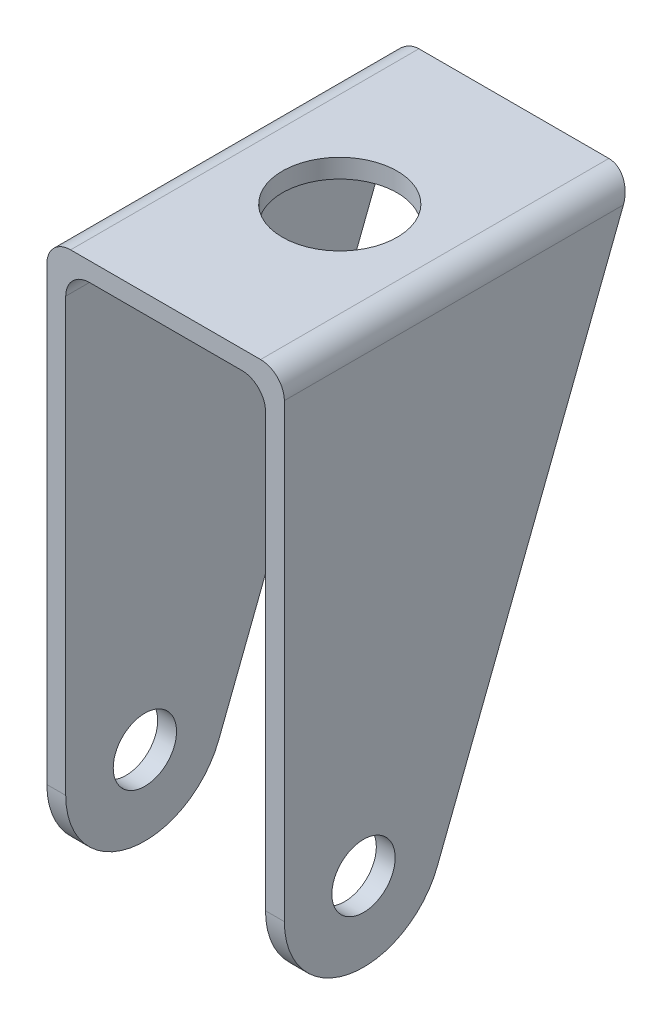
ISO-10303-21;
HEADER;
FILE_DESCRIPTION(('STEP AP214'),'2;1');
FILE_NAME('part.step','',(''),(''),'','','');
FILE_SCHEMA(('AUTOMOTIVE_DESIGN { 1 0 10303 214 1 1 1 1 }'));
ENDSEC;
DATA;
#1=APPLICATION_CONTEXT('core data for automotive mechanical design processes');
#2=APPLICATION_PROTOCOL_DEFINITION('international standard','automotive_design',2000,#1);
#3=PRODUCT_CONTEXT('',#1,'mechanical');
#4=PRODUCT('Part','Part','',(#3));
#5=PRODUCT_RELATED_PRODUCT_CATEGORY('part','',(#4));
#6=PRODUCT_DEFINITION_FORMATION('','',#4);
#7=PRODUCT_DEFINITION_CONTEXT('part definition',#1,'design');
#8=PRODUCT_DEFINITION('design','',#6,#7);
#9=PRODUCT_DEFINITION_SHAPE('','',#8);
#10=(LENGTH_UNIT() NAMED_UNIT(*) SI_UNIT(.MILLI.,.METRE.));
#11=(NAMED_UNIT(*) PLANE_ANGLE_UNIT() SI_UNIT($,.RADIAN.));
#12=(NAMED_UNIT(*) SI_UNIT($,.STERADIAN.) SOLID_ANGLE_UNIT());
#13=UNCERTAINTY_MEASURE_WITH_UNIT(LENGTH_MEASURE(1.E-05),#10,'distance_accuracy_value','');
#14=(GEOMETRIC_REPRESENTATION_CONTEXT(3) GLOBAL_UNCERTAINTY_ASSIGNED_CONTEXT((#13)) GLOBAL_UNIT_ASSIGNED_CONTEXT((#10,
#11,#12)) REPRESENTATION_CONTEXT('',''));
#15=CARTESIAN_POINT('',(0.,0.,0.));
#16=DIRECTION('',(0.,0.,1.));
#17=DIRECTION('',(1.,0.,0.));
#18=AXIS2_PLACEMENT_3D('',#15,#16,#17);
#19=CARTESIAN_POINT('',(-9.61999999999999,-5.38,0.));
#20=DIRECTION('',(0.,0.,-1.));
#21=DIRECTION('',(-1.,0.,0.));
#22=AXIS2_PLACEMENT_3D('',#19,#20,#21);
#23=CYLINDRICAL_SURFACE('',#22,3.);
#24=DIRECTION('',(0.,0.,-1.));
#25=VECTOR('',#24,1.);
#26=CARTESIAN_POINT('',(-9.61999999999999,-2.38,0.));
#27=LINE('',#26,#25);
#28=CARTESIAN_POINT('',(-9.62,-2.38,22.));
#29=VERTEX_POINT('',#28);
#30=CARTESIAN_POINT('',(-9.62,-2.38,-21.0767972413711));
#31=VERTEX_POINT('',#30);
#32=EDGE_CURVE('E214',#29,#31,#27,.T.);
#33=ORIENTED_EDGE('',*,*,#32,.F.);
#34=CARTESIAN_POINT('',(-9.61999999999999,-5.38,22.));
#35=DIRECTION('',(0.,0.,1.));
#36=DIRECTION('',(1.,0.,0.));
#37=AXIS2_PLACEMENT_3D('',#34,#35,#36);
#38=CIRCLE('',#37,3.);
#39=CARTESIAN_POINT('',(-12.62,-5.38,22.));
#40=VERTEX_POINT('',#39);
#41=EDGE_CURVE('E219',#29,#40,#38,.T.);
#42=ORIENTED_EDGE('',*,*,#41,.T.);
#43=DIRECTION('',(0.,0.,-1.));
#44=VECTOR('',#43,1.);
#45=CARTESIAN_POINT('',(-12.62,-5.38,12.));
#46=LINE('',#45,#44);
#47=CARTESIAN_POINT('',(-12.62,-5.38,-19.9130962851162));
#48=VERTEX_POINT('',#47);
#49=EDGE_CURVE('E217',#48,#40,#46,.F.);
#50=ORIENTED_EDGE('',*,*,#49,.F.);
#51=CARTESIAN_POINT('',(-9.61999999999999,-5.38,-19.9130962851162));
#52=DIRECTION('',(0.,-0.361645543914119,-0.932315665730798));
#53=DIRECTION('',(0.,0.932315665730798,-0.361645543914119));
#54=AXIS2_PLACEMENT_3D('',#51,#52,#53);
#55=ELLIPSE('',#54,3.21779426247058,3.);
#56=EDGE_CURVE('E130',#48,#31,#55,.T.);
#57=ORIENTED_EDGE('',*,*,#56,.T.);
#58=EDGE_LOOP('',(#33,#42,#50,#57));
#59=FACE_BOUND('',#58,.T.);
#60=ADVANCED_FACE('F33',(#59),#23,.F.);
#61=CARTESIAN_POINT('',(9.62,-5.38,0.));
#62=DIRECTION('',(0.,0.,1.));
#63=DIRECTION('',(1.,0.,0.));
#64=AXIS2_PLACEMENT_3D('',#61,#62,#63);
#65=CYLINDRICAL_SURFACE('',#64,3.);
#66=DIRECTION('',(0.,0.,1.));
#67=VECTOR('',#66,1.);
#68=CARTESIAN_POINT('',(9.62,-2.38,0.));
#69=LINE('',#68,#67);
#70=CARTESIAN_POINT('',(9.62,-2.38,-21.0767972413711));
#71=VERTEX_POINT('',#70);
#72=CARTESIAN_POINT('',(9.62,-2.38,22.));
#73=VERTEX_POINT('',#72);
#74=EDGE_CURVE('E202',#71,#73,#69,.T.);
#75=ORIENTED_EDGE('',*,*,#74,.F.);
#76=CARTESIAN_POINT('',(9.62,-5.38,-19.9130962851162));
#77=DIRECTION('',(0.,-0.361645543914119,-0.932315665730798));
#78=DIRECTION('',(0.,-0.932315665730798,0.361645543914119));
#79=AXIS2_PLACEMENT_3D('',#76,#77,#78);
#80=ELLIPSE('',#79,3.21779426247058,3.);
#81=CARTESIAN_POINT('',(12.62,-5.38,-19.9130962851162));
#82=VERTEX_POINT('',#81);
#83=EDGE_CURVE('E209',#71,#82,#80,.T.);
#84=ORIENTED_EDGE('',*,*,#83,.T.);
#85=DIRECTION('',(0.,0.,1.));
#86=VECTOR('',#85,1.);
#87=CARTESIAN_POINT('',(12.62,-5.38,12.));
#88=LINE('',#87,#86);
#89=CARTESIAN_POINT('',(12.62,-5.38,22.));
#90=VERTEX_POINT('',#89);
#91=EDGE_CURVE('E206',#90,#82,#88,.F.);
#92=ORIENTED_EDGE('',*,*,#91,.F.);
#93=CARTESIAN_POINT('',(9.62,-5.38,22.));
#94=DIRECTION('',(0.,0.,1.));
#95=DIRECTION('',(1.,0.,0.));
#96=AXIS2_PLACEMENT_3D('',#93,#94,#95);
#97=CIRCLE('',#96,3.);
#98=EDGE_CURVE('E211',#90,#73,#97,.T.);
#99=ORIENTED_EDGE('',*,*,#98,.T.);
#100=EDGE_LOOP('',(#75,#84,#92,#99));
#101=FACE_BOUND('',#100,.T.);
#102=ADVANCED_FACE('F259',(#101),#65,.F.);
#103=CARTESIAN_POINT('',(0.,-2.38,0.));
#104=DIRECTION('',(0.,-1.,0.));
#105=DIRECTION('',(0.,0.,-1.));
#106=AXIS2_PLACEMENT_3D('',#103,#104,#105);
#107=PLANE('',#106);
#108=CARTESIAN_POINT('',(0.,-2.38,0.));
#109=DIRECTION('',(0.,1.,0.));
#110=DIRECTION('',(0.,0.,1.));
#111=AXIS2_PLACEMENT_3D('',#108,#109,#110);
#112=CIRCLE('',#111,7.25);
#113=CARTESIAN_POINT('',(0.,-2.38,7.24999999999999));
#114=VERTEX_POINT('',#113);
#115=EDGE_CURVE('E186',#114,#114,#112,.T.);
#116=ORIENTED_EDGE('',*,*,#115,.T.);
#117=EDGE_LOOP('',(#116));
#118=FACE_BOUND('',#117,.T.);
#119=DIRECTION('',(1.,0.,0.));
#120=VECTOR('',#119,1.);
#121=CARTESIAN_POINT('',(-15.,-2.38,22.));
#122=LINE('',#121,#120);
#123=EDGE_CURVE('E192',#29,#73,#122,.T.);
#124=ORIENTED_EDGE('',*,*,#123,.F.);
#125=ORIENTED_EDGE('',*,*,#32,.T.);
#126=DIRECTION('',(1.,0.,0.));
#127=VECTOR('',#126,1.);
#128=CARTESIAN_POINT('',(-15.,-2.38,-21.0767972413711));
#129=LINE('',#128,#127);
#130=EDGE_CURVE('E159',#31,#71,#129,.T.);
#131=ORIENTED_EDGE('',*,*,#130,.T.);
#132=ORIENTED_EDGE('',*,*,#74,.T.);
#133=EDGE_LOOP('',(#124,#125,#131,#132));
#134=FACE_BOUND('',#133,.T.);
#135=ADVANCED_FACE('F262',(#118,#134),#107,.T.);
#136=CARTESIAN_POINT('',(15.,-2.38,22.));
#137=DIRECTION('',(1.,0.,0.));
#138=DIRECTION('',(0.,0.,-1.));
#139=AXIS2_PLACEMENT_3D('',#136,#137,#138);
#140=PLANE('',#139);
#141=DIRECTION('',(0.,0.932315665730798,-0.361645543914119));
#142=VECTOR('',#141,1.);
#143=CARTESIAN_POINT('',(15.,0.,-22.));
#144=LINE('',#143,#142);
#145=CARTESIAN_POINT('',(15.,-63.6164554391412,2.676843342692));
#146=VERTEX_POINT('',#145);
#147=CARTESIAN_POINT('',(15.,-3.,-20.8362990437451));
#148=VERTEX_POINT('',#147);
#149=EDGE_CURVE('E172',#146,#148,#144,.T.);
#150=ORIENTED_EDGE('',*,*,#149,.T.);
#151=DIRECTION('',(0.,0.,-1.));
#152=VECTOR('',#151,1.);
#153=CARTESIAN_POINT('',(15.,-3.,22.));
#154=LINE('',#153,#152);
#155=CARTESIAN_POINT('',(15.,-3.,22.));
#156=VERTEX_POINT('',#155);
#157=EDGE_CURVE('E56',#148,#156,#154,.F.);
#158=ORIENTED_EDGE('',*,*,#157,.T.);
#159=DIRECTION('',(0.,1.,0.));
#160=VECTOR('',#159,1.);
#161=CARTESIAN_POINT('',(15.,-2.38,22.));
#162=LINE('',#161,#160);
#163=CARTESIAN_POINT('',(15.,-60.,22.));
#164=VERTEX_POINT('',#163);
#165=EDGE_CURVE('E200',#164,#156,#162,.T.);
#166=ORIENTED_EDGE('',*,*,#165,.F.);
#167=CARTESIAN_POINT('',(15.,-60.,12.));
#168=DIRECTION('',(1.,0.,0.));
#169=DIRECTION('',(0.,0.,-1.));
#170=AXIS2_PLACEMENT_3D('',#167,#168,#169);
#171=CIRCLE('',#170,10.);
#172=EDGE_CURVE('E165',#164,#146,#171,.T.);
#173=ORIENTED_EDGE('',*,*,#172,.T.);
#174=EDGE_LOOP('',(#150,#158,#166,#173));
#175=FACE_BOUND('',#174,.T.);
#176=CARTESIAN_POINT('',(15.,-60.,12.));
#177=DIRECTION('',(1.,0.,0.));
#178=DIRECTION('',(0.,0.,-1.));
#179=AXIS2_PLACEMENT_3D('',#176,#177,#178);
#180=CIRCLE('',#179,4.);
#181=CARTESIAN_POINT('',(15.,-60.,7.99999999999999));
#182=VERTEX_POINT('',#181);
#183=EDGE_CURVE('E161',#182,#182,#180,.T.);
#184=ORIENTED_EDGE('',*,*,#183,.F.);
#185=EDGE_LOOP('',(#184));
#186=FACE_BOUND('',#185,.T.);
#187=ADVANCED_FACE('F243',(#175,#186),#140,.T.);
#188=CARTESIAN_POINT('',(-15.,-2.38,22.));
#189=DIRECTION('',(0.,0.,1.));
#190=DIRECTION('',(1.,0.,0.));
#191=AXIS2_PLACEMENT_3D('',#188,#189,#190);
#192=PLANE('',#191);
#193=ORIENTED_EDGE('',*,*,#165,.T.);
#194=CARTESIAN_POINT('',(12.,-3.,22.));
#195=DIRECTION('',(0.,0.,1.));
#196=DIRECTION('',(1.,0.,0.));
#197=AXIS2_PLACEMENT_3D('',#194,#195,#196);
#198=CIRCLE('',#197,3.);
#199=CARTESIAN_POINT('',(12.,0.,22.));
#200=VERTEX_POINT('',#199);
#201=EDGE_CURVE('E41',#156,#200,#198,.T.);
#202=ORIENTED_EDGE('',*,*,#201,.T.);
#203=DIRECTION('',(1.,0.,0.));
#204=VECTOR('',#203,1.);
#205=CARTESIAN_POINT('',(-15.,0.,22.));
#206=LINE('',#205,#204);
#207=CARTESIAN_POINT('',(-12.,0.,22.));
#208=VERTEX_POINT('',#207);
#209=EDGE_CURVE('E195',#208,#200,#206,.T.);
#210=ORIENTED_EDGE('',*,*,#209,.F.);
#211=CARTESIAN_POINT('',(-12.,-3.,22.));
#212=DIRECTION('',(0.,0.,1.));
#213=DIRECTION('',(1.,0.,0.));
#214=AXIS2_PLACEMENT_3D('',#211,#212,#213);
#215=CIRCLE('',#214,3.);
#216=CARTESIAN_POINT('',(-15.,-3.,22.));
#217=VERTEX_POINT('',#216);
#218=EDGE_CURVE('E48',#208,#217,#215,.T.);
#219=ORIENTED_EDGE('',*,*,#218,.T.);
#220=DIRECTION('',(0.,1.,0.));
#221=VECTOR('',#220,1.);
#222=CARTESIAN_POINT('',(-15.,-2.38,22.));
#223=LINE('',#222,#221);
#224=CARTESIAN_POINT('',(-15.,-60.,22.));
#225=VERTEX_POINT('',#224);
#226=EDGE_CURVE('E194',#225,#217,#223,.T.);
#227=ORIENTED_EDGE('',*,*,#226,.F.);
#228=DIRECTION('',(-1.,0.,0.));
#229=VECTOR('',#228,1.);
#230=CARTESIAN_POINT('',(-12.62,-60.,22.));
#231=LINE('',#230,#229);
#232=CARTESIAN_POINT('',(-12.62,-60.,22.));
#233=VERTEX_POINT('',#232);
#234=EDGE_CURVE('E144',#233,#225,#231,.T.);
#235=ORIENTED_EDGE('',*,*,#234,.F.);
#236=DIRECTION('',(0.,1.,0.));
#237=VECTOR('',#236,1.);
#238=CARTESIAN_POINT('',(-12.62,0.,22.));
#239=LINE('',#238,#237);
#240=EDGE_CURVE('E145',#233,#40,#239,.T.);
#241=ORIENTED_EDGE('',*,*,#240,.T.);
#242=ORIENTED_EDGE('',*,*,#41,.F.);
#243=ORIENTED_EDGE('',*,*,#123,.T.);
#244=ORIENTED_EDGE('',*,*,#98,.F.);
#245=DIRECTION('',(0.,-1.,0.));
#246=VECTOR('',#245,1.);
#247=CARTESIAN_POINT('',(12.62,-60.,22.));
#248=LINE('',#247,#246);
#249=CARTESIAN_POINT('',(12.62,-60.,22.));
#250=VERTEX_POINT('',#249);
#251=EDGE_CURVE('E175',#90,#250,#248,.T.);
#252=ORIENTED_EDGE('',*,*,#251,.T.);
#253=DIRECTION('',(1.,0.,0.));
#254=VECTOR('',#253,1.);
#255=CARTESIAN_POINT('',(12.62,-60.,22.));
#256=LINE('',#255,#254);
#257=EDGE_CURVE('E181',#250,#164,#256,.T.);
#258=ORIENTED_EDGE('',*,*,#257,.T.);
#259=EDGE_LOOP('',(#193,#202,#210,#219,#227,#235,#241,#242,#243,#244,#252,#258));
#260=FACE_BOUND('',#259,.T.);
#261=ADVANCED_FACE('F234',(#260),#192,.T.);
#262=CARTESIAN_POINT('',(-15.,-2.38,22.));
#263=DIRECTION('',(-1.,0.,0.));
#264=DIRECTION('',(0.,0.,1.));
#265=AXIS2_PLACEMENT_3D('',#262,#263,#264);
#266=PLANE('',#265);
#267=ORIENTED_EDGE('',*,*,#226,.T.);
#268=DIRECTION('',(0.,0.,1.));
#269=VECTOR('',#268,1.);
#270=CARTESIAN_POINT('',(-15.,-3.,-22.));
#271=LINE('',#270,#269);
#272=CARTESIAN_POINT('',(-15.,-3.,-20.8362990437451));
#273=VERTEX_POINT('',#272);
#274=EDGE_CURVE('E11',#217,#273,#271,.F.);
#275=ORIENTED_EDGE('',*,*,#274,.T.);
#276=DIRECTION('',(0.,-0.932315665730798,0.36164554391412));
#277=VECTOR('',#276,1.);
#278=CARTESIAN_POINT('',(-15.,0.,-22.));
#279=LINE('',#278,#277);
#280=CARTESIAN_POINT('',(-15.,-63.6164554391412,2.676843342692));
#281=VERTEX_POINT('',#280);
#282=EDGE_CURVE('E156',#273,#281,#279,.T.);
#283=ORIENTED_EDGE('',*,*,#282,.T.);
#284=CARTESIAN_POINT('',(-15.,-60.,12.));
#285=DIRECTION('',(-1.,0.,0.));
#286=DIRECTION('',(0.,0.,1.));
#287=AXIS2_PLACEMENT_3D('',#284,#285,#286);
#288=CIRCLE('',#287,10.);
#289=EDGE_CURVE('E136',#281,#225,#288,.T.);
#290=ORIENTED_EDGE('',*,*,#289,.T.);
#291=EDGE_LOOP('',(#267,#275,#283,#290));
#292=FACE_BOUND('',#291,.T.);
#293=CARTESIAN_POINT('',(-15.,-60.,12.));
#294=DIRECTION('',(-1.,0.,0.));
#295=DIRECTION('',(0.,0.,1.));
#296=AXIS2_PLACEMENT_3D('',#293,#294,#295);
#297=CIRCLE('',#296,4.);
#298=CARTESIAN_POINT('',(-15.,-60.,16.));
#299=VERTEX_POINT('',#298);
#300=EDGE_CURVE('E321',#299,#299,#297,.T.);
#301=ORIENTED_EDGE('',*,*,#300,.F.);
#302=EDGE_LOOP('',(#301));
#303=FACE_BOUND('',#302,.T.);
#304=ADVANCED_FACE('F266',(#292,#303),#266,.T.);
#305=CARTESIAN_POINT('',(0.,0.,0.));
#306=DIRECTION('',(0.,-1.,0.));
#307=DIRECTION('',(0.,0.,-1.));
#308=AXIS2_PLACEMENT_3D('',#305,#306,#307);
#309=PLANE('',#308);
#310=ORIENTED_EDGE('',*,*,#209,.T.);
#311=DIRECTION('',(0.,0.,-1.));
#312=VECTOR('',#311,1.);
#313=CARTESIAN_POINT('',(12.,0.,-22.));
#314=LINE('',#313,#312);
#315=CARTESIAN_POINT('',(12.,0.,-22.));
#316=VERTEX_POINT('',#315);
#317=EDGE_CURVE('E225',#200,#316,#314,.T.);
#318=ORIENTED_EDGE('',*,*,#317,.T.);
#319=DIRECTION('',(-1.,0.,0.));
#320=VECTOR('',#319,1.);
#321=CARTESIAN_POINT('',(-15.,0.,-22.));
#322=LINE('',#321,#320);
#323=CARTESIAN_POINT('',(-12.,0.,-22.));
#324=VERTEX_POINT('',#323);
#325=EDGE_CURVE('E189',#316,#324,#322,.T.);
#326=ORIENTED_EDGE('',*,*,#325,.T.);
#327=DIRECTION('',(0.,0.,1.));
#328=VECTOR('',#327,1.);
#329=CARTESIAN_POINT('',(-12.,0.,22.));
#330=LINE('',#329,#328);
#331=EDGE_CURVE('E222',#324,#208,#330,.T.);
#332=ORIENTED_EDGE('',*,*,#331,.T.);
#333=EDGE_LOOP('',(#310,#318,#326,#332));
#334=FACE_BOUND('',#333,.T.);
#335=CARTESIAN_POINT('',(0.,0.,0.));
#336=DIRECTION('',(0.,1.,0.));
#337=DIRECTION('',(0.,0.,1.));
#338=AXIS2_PLACEMENT_3D('',#335,#336,#337);
#339=CIRCLE('',#338,7.25);
#340=CARTESIAN_POINT('',(0.,0.,7.24999999999999));
#341=VERTEX_POINT('',#340);
#342=EDGE_CURVE('E184',#341,#341,#339,.T.);
#343=ORIENTED_EDGE('',*,*,#342,.F.);
#344=EDGE_LOOP('',(#343));
#345=FACE_BOUND('',#344,.T.);
#346=ADVANCED_FACE('F238',(#334,#345),#309,.F.);
#347=CARTESIAN_POINT('',(0.,-2.38,0.));
#348=DIRECTION('',(0.,1.,0.));
#349=DIRECTION('',(0.,0.,1.));
#350=AXIS2_PLACEMENT_3D('',#347,#348,#349);
#351=CYLINDRICAL_SURFACE('',#350,7.25);
#352=ORIENTED_EDGE('',*,*,#115,.F.);
#353=EDGE_LOOP('',(#352));
#354=FACE_BOUND('',#353,.T.);
#355=ORIENTED_EDGE('',*,*,#342,.T.);
#356=EDGE_LOOP('',(#355));
#357=FACE_BOUND('',#356,.T.);
#358=ADVANCED_FACE('F291',(#354,#357),#351,.F.);
#359=CARTESIAN_POINT('',(12.62,-60.,12.));
#360=DIRECTION('',(1.,0.,0.));
#361=DIRECTION('',(0.,0.,-1.));
#362=AXIS2_PLACEMENT_3D('',#359,#360,#361);
#363=CYLINDRICAL_SURFACE('',#362,10.);
#364=ORIENTED_EDGE('',*,*,#172,.F.);
#365=ORIENTED_EDGE('',*,*,#257,.F.);
#366=CARTESIAN_POINT('',(12.62,-60.,12.));
#367=DIRECTION('',(1.,0.,0.));
#368=DIRECTION('',(0.,0.,-1.));
#369=AXIS2_PLACEMENT_3D('',#366,#367,#368);
#370=CIRCLE('',#369,10.);
#371=CARTESIAN_POINT('',(12.62,-63.6164554391412,2.676843342692));
#372=VERTEX_POINT('',#371);
#373=EDGE_CURVE('E168',#250,#372,#370,.T.);
#374=ORIENTED_EDGE('',*,*,#373,.T.);
#375=DIRECTION('',(1.,0.,0.));
#376=VECTOR('',#375,1.);
#377=CARTESIAN_POINT('',(12.62,-63.6164554391412,2.676843342692));
#378=LINE('',#377,#376);
#379=EDGE_CURVE('E177',#372,#146,#378,.T.);
#380=ORIENTED_EDGE('',*,*,#379,.T.);
#381=EDGE_LOOP('',(#364,#365,#374,#380));
#382=FACE_BOUND('',#381,.T.);
#383=ADVANCED_FACE('F248',(#382),#363,.T.);
#384=CARTESIAN_POINT('',(12.62,0.,-22.));
#385=DIRECTION('',(0.,-0.361645543914119,-0.932315665730798));
#386=DIRECTION('',(0.,0.932315665730798,-0.361645543914119));
#387=AXIS2_PLACEMENT_3D('',#384,#385,#386);
#388=PLANE('',#387);
#389=ORIENTED_EDGE('',*,*,#325,.F.);
#390=CARTESIAN_POINT('',(12.,-3.,-20.8362990437451));
#391=DIRECTION('',(0.,-0.361645543914119,-0.932315665730798));
#392=DIRECTION('',(0.,-0.932315665730798,0.361645543914119));
#393=AXIS2_PLACEMENT_3D('',#390,#391,#392);
#394=ELLIPSE('',#393,3.21779426247058,3.);
#395=EDGE_CURVE('E230',#316,#148,#394,.T.);
#396=ORIENTED_EDGE('',*,*,#395,.T.);
#397=ORIENTED_EDGE('',*,*,#149,.F.);
#398=ORIENTED_EDGE('',*,*,#379,.F.);
#399=DIRECTION('',(0.,0.932315665730798,-0.361645543914119));
#400=VECTOR('',#399,1.);
#401=CARTESIAN_POINT('',(12.62,0.,-22.));
#402=LINE('',#401,#400);
#403=EDGE_CURVE('E171',#372,#82,#402,.T.);
#404=ORIENTED_EDGE('',*,*,#403,.T.);
#405=ORIENTED_EDGE('',*,*,#83,.F.);
#406=ORIENTED_EDGE('',*,*,#130,.F.);
#407=ORIENTED_EDGE('',*,*,#56,.F.);
#408=DIRECTION('',(0.,-0.932315665730798,0.361645543914119));
#409=VECTOR('',#408,1.);
#410=CARTESIAN_POINT('',(-12.62,0.,-22.));
#411=LINE('',#410,#409);
#412=CARTESIAN_POINT('',(-12.62,-63.6164554391412,2.676843342692));
#413=VERTEX_POINT('',#412);
#414=EDGE_CURVE('E122',#48,#413,#411,.T.);
#415=ORIENTED_EDGE('',*,*,#414,.T.);
#416=DIRECTION('',(-1.,0.,0.));
#417=VECTOR('',#416,1.);
#418=CARTESIAN_POINT('',(-12.62,-63.6164554391412,2.676843342692));
#419=LINE('',#418,#417);
#420=EDGE_CURVE('E127',#413,#281,#419,.T.);
#421=ORIENTED_EDGE('',*,*,#420,.T.);
#422=ORIENTED_EDGE('',*,*,#282,.F.);
#423=CARTESIAN_POINT('',(-12.,-3.,-20.8362990437451));
#424=DIRECTION('',(0.,-0.361645543914119,-0.932315665730798));
#425=DIRECTION('',(0.,0.932315665730798,-0.361645543914119));
#426=AXIS2_PLACEMENT_3D('',#423,#424,#425);
#427=ELLIPSE('',#426,3.21779426247058,3.);
#428=EDGE_CURVE('E228',#273,#324,#427,.T.);
#429=ORIENTED_EDGE('',*,*,#428,.T.);
#430=EDGE_LOOP('',(#389,#396,#397,#398,#404,#405,#406,#407,#415,#421,#422,#429));
#431=FACE_BOUND('',#430,.T.);
#432=ADVANCED_FACE('F125',(#431),#388,.T.);
#433=CARTESIAN_POINT('',(12.62,-60.,12.));
#434=DIRECTION('',(1.,0.,0.));
#435=DIRECTION('',(0.,0.,-1.));
#436=AXIS2_PLACEMENT_3D('',#433,#434,#435);
#437=PLANE('',#436);
#438=ORIENTED_EDGE('',*,*,#251,.F.);
#439=ORIENTED_EDGE('',*,*,#91,.T.);
#440=ORIENTED_EDGE('',*,*,#403,.F.);
#441=ORIENTED_EDGE('',*,*,#373,.F.);
#442=EDGE_LOOP('',(#438,#439,#440,#441));
#443=FACE_BOUND('',#442,.T.);
#444=CARTESIAN_POINT('',(12.62,-60.,12.));
#445=DIRECTION('',(1.,0.,0.));
#446=DIRECTION('',(0.,0.,-1.));
#447=AXIS2_PLACEMENT_3D('',#444,#445,#446);
#448=CIRCLE('',#447,4.);
#449=CARTESIAN_POINT('',(12.62,-60.,7.99999999999999));
#450=VERTEX_POINT('',#449);
#451=EDGE_CURVE('E162',#450,#450,#448,.T.);
#452=ORIENTED_EDGE('',*,*,#451,.T.);
#453=EDGE_LOOP('',(#452));
#454=FACE_BOUND('',#453,.T.);
#455=ADVANCED_FACE('F254',(#443,#454),#437,.F.);
#456=CARTESIAN_POINT('',(12.62,-60.,12.));
#457=DIRECTION('',(1.,0.,0.));
#458=DIRECTION('',(0.,0.,-1.));
#459=AXIS2_PLACEMENT_3D('',#456,#457,#458);
#460=CYLINDRICAL_SURFACE('',#459,4.);
#461=ORIENTED_EDGE('',*,*,#451,.F.);
#462=EDGE_LOOP('',(#461));
#463=FACE_BOUND('',#462,.T.);
#464=ORIENTED_EDGE('',*,*,#183,.T.);
#465=EDGE_LOOP('',(#464));
#466=FACE_BOUND('',#465,.T.);
#467=ADVANCED_FACE('F304',(#463,#466),#460,.F.);
#468=CARTESIAN_POINT('',(-12.62,-60.,12.));
#469=DIRECTION('',(-1.,0.,0.));
#470=DIRECTION('',(0.,0.,1.));
#471=AXIS2_PLACEMENT_3D('',#468,#469,#470);
#472=CYLINDRICAL_SURFACE('',#471,10.);
#473=ORIENTED_EDGE('',*,*,#289,.F.);
#474=ORIENTED_EDGE('',*,*,#420,.F.);
#475=CARTESIAN_POINT('',(-12.62,-60.,12.));
#476=DIRECTION('',(-1.,0.,0.));
#477=DIRECTION('',(0.,0.,1.));
#478=AXIS2_PLACEMENT_3D('',#475,#476,#477);
#479=CIRCLE('',#478,10.);
#480=EDGE_CURVE('E135',#413,#233,#479,.T.);
#481=ORIENTED_EDGE('',*,*,#480,.T.);
#482=ORIENTED_EDGE('',*,*,#234,.T.);
#483=EDGE_LOOP('',(#473,#474,#481,#482));
#484=FACE_BOUND('',#483,.T.);
#485=ADVANCED_FACE('F140',(#484),#472,.T.);
#486=CARTESIAN_POINT('',(-12.62,-60.,12.));
#487=DIRECTION('',(-1.,0.,0.));
#488=DIRECTION('',(0.,0.,1.));
#489=AXIS2_PLACEMENT_3D('',#486,#487,#488);
#490=PLANE('',#489);
#491=ORIENTED_EDGE('',*,*,#414,.F.);
#492=ORIENTED_EDGE('',*,*,#49,.T.);
#493=ORIENTED_EDGE('',*,*,#240,.F.);
#494=ORIENTED_EDGE('',*,*,#480,.F.);
#495=EDGE_LOOP('',(#491,#492,#493,#494));
#496=FACE_BOUND('',#495,.T.);
#497=CARTESIAN_POINT('',(-12.62,-60.,12.));
#498=DIRECTION('',(-1.,0.,0.));
#499=DIRECTION('',(0.,0.,1.));
#500=AXIS2_PLACEMENT_3D('',#497,#498,#499);
#501=CIRCLE('',#500,4.);
#502=CARTESIAN_POINT('',(-12.62,-60.,16.));
#503=VERTEX_POINT('',#502);
#504=EDGE_CURVE('E155',#503,#503,#501,.T.);
#505=ORIENTED_EDGE('',*,*,#504,.T.);
#506=EDGE_LOOP('',(#505));
#507=FACE_BOUND('',#506,.T.);
#508=ADVANCED_FACE('F147',(#496,#507),#490,.F.);
#509=CARTESIAN_POINT('',(-12.62,-60.,12.));
#510=DIRECTION('',(-1.,0.,0.));
#511=DIRECTION('',(0.,0.,1.));
#512=AXIS2_PLACEMENT_3D('',#509,#510,#511);
#513=CYLINDRICAL_SURFACE('',#512,4.);
#514=ORIENTED_EDGE('',*,*,#504,.F.);
#515=EDGE_LOOP('',(#514));
#516=FACE_BOUND('',#515,.T.);
#517=ORIENTED_EDGE('',*,*,#300,.T.);
#518=EDGE_LOOP('',(#517));
#519=FACE_BOUND('',#518,.T.);
#520=ADVANCED_FACE('F275',(#516,#519),#513,.F.);
#521=CARTESIAN_POINT('',(12.,-3.,0.));
#522=DIRECTION('',(0.,0.,1.));
#523=DIRECTION('',(1.,0.,0.));
#524=AXIS2_PLACEMENT_3D('',#521,#522,#523);
#525=CYLINDRICAL_SURFACE('',#524,3.);
#526=ORIENTED_EDGE('',*,*,#201,.F.);
#527=ORIENTED_EDGE('',*,*,#157,.F.);
#528=ORIENTED_EDGE('',*,*,#395,.F.);
#529=ORIENTED_EDGE('',*,*,#317,.F.);
#530=EDGE_LOOP('',(#526,#527,#528,#529));
#531=FACE_BOUND('',#530,.T.);
#532=ADVANCED_FACE('F241',(#531),#525,.T.);
#533=CARTESIAN_POINT('',(-12.,-3.,0.));
#534=DIRECTION('',(0.,0.,-1.));
#535=DIRECTION('',(-1.,0.,0.));
#536=AXIS2_PLACEMENT_3D('',#533,#534,#535);
#537=CYLINDRICAL_SURFACE('',#536,3.);
#538=ORIENTED_EDGE('',*,*,#428,.F.);
#539=ORIENTED_EDGE('',*,*,#274,.F.);
#540=ORIENTED_EDGE('',*,*,#218,.F.);
#541=ORIENTED_EDGE('',*,*,#331,.F.);
#542=EDGE_LOOP('',(#538,#539,#540,#541));
#543=FACE_BOUND('',#542,.T.);
#544=ADVANCED_FACE('F35',(#543),#537,.T.);
#545=CLOSED_SHELL('',(#60,#102,#135,#187,#261,#304,#346,#358,#383,#432,#455,#467,#485,#508,#520,
#532,#544));
#546=MANIFOLD_SOLID_BREP('B2',#545);
#547=ADVANCED_BREP_SHAPE_REPRESENTATION('',(#18,#546),#14);
#548=SHAPE_DEFINITION_REPRESENTATION(#9,#547);
ENDSEC;
END-ISO-10303-21;
